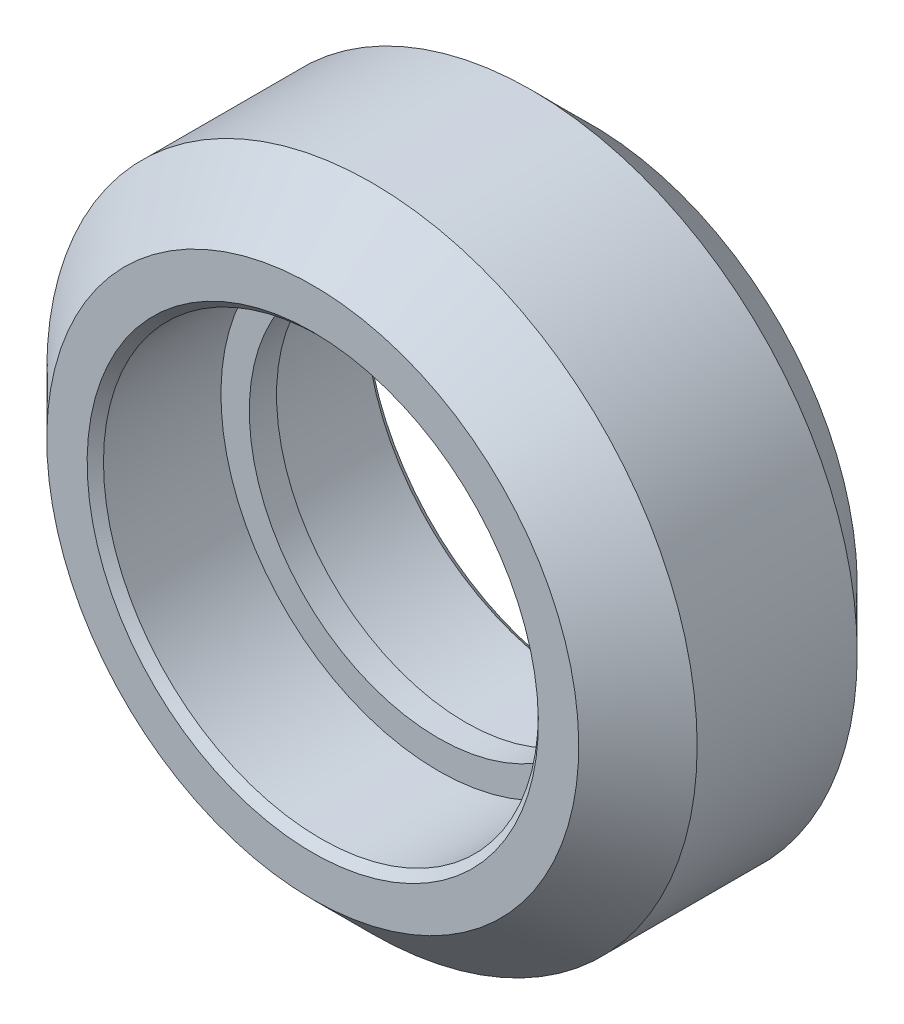
ISO-10303-21;
HEADER;
FILE_DESCRIPTION(('STEP AP214'),'2;1');
FILE_NAME('part.step','',(''),(''),'','','');
FILE_SCHEMA(('AUTOMOTIVE_DESIGN { 1 0 10303 214 1 1 1 1 }'));
ENDSEC;
DATA;
#1=APPLICATION_CONTEXT('core data for automotive mechanical design processes');
#2=APPLICATION_PROTOCOL_DEFINITION('international standard','automotive_design',2000,#1);
#3=PRODUCT_CONTEXT('',#1,'mechanical');
#4=PRODUCT('Part','Part','',(#3));
#5=PRODUCT_RELATED_PRODUCT_CATEGORY('part','',(#4));
#6=PRODUCT_DEFINITION_FORMATION('','',#4);
#7=PRODUCT_DEFINITION_CONTEXT('part definition',#1,'design');
#8=PRODUCT_DEFINITION('design','',#6,#7);
#9=PRODUCT_DEFINITION_SHAPE('','',#8);
#10=(LENGTH_UNIT() NAMED_UNIT(*) SI_UNIT(.MILLI.,.METRE.));
#11=(NAMED_UNIT(*) PLANE_ANGLE_UNIT() SI_UNIT($,.RADIAN.));
#12=(NAMED_UNIT(*) SI_UNIT($,.STERADIAN.) SOLID_ANGLE_UNIT());
#13=UNCERTAINTY_MEASURE_WITH_UNIT(LENGTH_MEASURE(1.E-05),#10,'distance_accuracy_value','');
#14=(GEOMETRIC_REPRESENTATION_CONTEXT(3) GLOBAL_UNCERTAINTY_ASSIGNED_CONTEXT((#13)) GLOBAL_UNIT_ASSIGNED_CONTEXT((#10,
#11,#12)) REPRESENTATION_CONTEXT('',''));
#15=CARTESIAN_POINT('',(0.,0.,0.));
#16=DIRECTION('',(0.,0.,1.));
#17=DIRECTION('',(1.,0.,0.));
#18=AXIS2_PLACEMENT_3D('',#15,#16,#17);
#19=CARTESIAN_POINT('',(0.,0.,5.115));
#20=DIRECTION('',(0.,0.,1.));
#21=DIRECTION('',(0.,-1.,0.));
#22=AXIS2_PLACEMENT_3D('',#19,#20,#21);
#23=CYLINDRICAL_SURFACE('',#22,7.987);
#24=CARTESIAN_POINT('',(0.,0.,4.815));
#25=DIRECTION('',(0.,0.,-1.));
#26=DIRECTION('',(0.,1.,0.));
#27=AXIS2_PLACEMENT_3D('',#24,#25,#26);
#28=CIRCLE('',#27,7.987);
#29=CARTESIAN_POINT('',(0.,7.987,4.815));
#30=VERTEX_POINT('',#29);
#31=EDGE_CURVE('E45',#30,#30,#28,.F.);
#32=ORIENTED_EDGE('',*,*,#31,.T.);
#33=EDGE_LOOP('',(#32));
#34=FACE_BOUND('',#33,.T.);
#35=CARTESIAN_POINT('',(0.,0.,0.499999999999998));
#36=DIRECTION('',(0.,0.,1.));
#37=DIRECTION('',(0.,-1.,0.));
#38=AXIS2_PLACEMENT_3D('',#35,#36,#37);
#39=CIRCLE('',#38,7.987);
#40=CARTESIAN_POINT('',(0.,-7.987,0.499999999999996));
#41=VERTEX_POINT('',#40);
#42=EDGE_CURVE('E71',#41,#41,#39,.T.);
#43=ORIENTED_EDGE('',*,*,#42,.F.);
#44=EDGE_LOOP('',(#43));
#45=FACE_BOUND('',#44,.T.);
#46=ADVANCED_FACE('F30',(#34,#45),#23,.F.);
#47=CARTESIAN_POINT('',(0.,9.77,5.115));
#48=DIRECTION('',(0.,0.,-1.));
#49=DIRECTION('',(0.,1.,0.));
#50=AXIS2_PLACEMENT_3D('',#47,#48,#49);
#51=PLANE('',#50);
#52=CARTESIAN_POINT('',(0.,0.,5.115));
#53=DIRECTION('',(0.,0.,-1.));
#54=DIRECTION('',(0.,1.,0.));
#55=AXIS2_PLACEMENT_3D('',#52,#53,#54);
#56=CIRCLE('',#55,8.28699999999999);
#57=CARTESIAN_POINT('',(0.,8.28699999999999,5.115));
#58=VERTEX_POINT('',#57);
#59=EDGE_CURVE('E41',#58,#58,#56,.T.);
#60=ORIENTED_EDGE('',*,*,#59,.T.);
#61=EDGE_LOOP('',(#60));
#62=FACE_BOUND('',#61,.T.);
#63=CARTESIAN_POINT('',(0.,0.,5.115));
#64=DIRECTION('',(0.,0.,1.));
#65=DIRECTION('',(0.,-1.,0.));
#66=AXIS2_PLACEMENT_3D('',#63,#64,#65);
#67=CIRCLE('',#66,9.77);
#68=CARTESIAN_POINT('',(0.,-9.77,5.115));
#69=VERTEX_POINT('',#68);
#70=EDGE_CURVE('E50',#69,#69,#67,.T.);
#71=ORIENTED_EDGE('',*,*,#70,.T.);
#72=EDGE_LOOP('',(#71));
#73=FACE_BOUND('',#72,.T.);
#74=ADVANCED_FACE('F78',(#62,#73),#51,.F.);
#75=CARTESIAN_POINT('',(0.,0.,2.94));
#76=DIRECTION('',(0.,0.,-1.));
#77=DIRECTION('',(0.,1.,0.));
#78=AXIS2_PLACEMENT_3D('',#75,#76,#77);
#79=CONICAL_SURFACE('',#78,11.945,0.78539816339745);
#80=ORIENTED_EDGE('',*,*,#70,.F.);
#81=EDGE_LOOP('',(#80));
#82=FACE_BOUND('',#81,.T.);
#83=CARTESIAN_POINT('',(0.,0.,2.94));
#84=DIRECTION('',(0.,0.,1.));
#85=DIRECTION('',(0.,-1.,0.));
#86=AXIS2_PLACEMENT_3D('',#83,#84,#85);
#87=CIRCLE('',#86,11.945);
#88=CARTESIAN_POINT('',(0.,-11.945,2.94));
#89=VERTEX_POINT('',#88);
#90=EDGE_CURVE('E53',#89,#89,#87,.T.);
#91=ORIENTED_EDGE('',*,*,#90,.T.);
#92=EDGE_LOOP('',(#91));
#93=FACE_BOUND('',#92,.T.);
#94=ADVANCED_FACE('F84',(#82,#93),#79,.T.);
#95=CARTESIAN_POINT('',(0.,0.,5.115));
#96=DIRECTION('',(0.,0.,1.));
#97=DIRECTION('',(0.,-1.,0.));
#98=AXIS2_PLACEMENT_3D('',#95,#96,#97);
#99=CYLINDRICAL_SURFACE('',#98,11.945);
#100=ORIENTED_EDGE('',*,*,#90,.F.);
#101=EDGE_LOOP('',(#100));
#102=FACE_BOUND('',#101,.T.);
#103=CARTESIAN_POINT('',(0.,0.,-2.94000000000001));
#104=DIRECTION('',(0.,0.,1.));
#105=DIRECTION('',(0.,-1.,0.));
#106=AXIS2_PLACEMENT_3D('',#103,#104,#105);
#107=CIRCLE('',#106,11.945);
#108=CARTESIAN_POINT('',(0.,-11.945,-2.94000000000001));
#109=VERTEX_POINT('',#108);
#110=EDGE_CURVE('E56',#109,#109,#107,.T.);
#111=ORIENTED_EDGE('',*,*,#110,.T.);
#112=EDGE_LOOP('',(#111));
#113=FACE_BOUND('',#112,.T.);
#114=ADVANCED_FACE('F107',(#102,#113),#99,.T.);
#115=CARTESIAN_POINT('',(0.,0.,-5.115));
#116=DIRECTION('',(0.,0.,1.));
#117=DIRECTION('',(0.,-1.,0.));
#118=AXIS2_PLACEMENT_3D('',#115,#116,#117);
#119=CONICAL_SURFACE('',#118,9.77,0.78539816339745);
#120=ORIENTED_EDGE('',*,*,#110,.F.);
#121=EDGE_LOOP('',(#120));
#122=FACE_BOUND('',#121,.T.);
#123=CARTESIAN_POINT('',(0.,0.,-5.115));
#124=DIRECTION('',(0.,0.,1.));
#125=DIRECTION('',(0.,-1.,0.));
#126=AXIS2_PLACEMENT_3D('',#123,#124,#125);
#127=CIRCLE('',#126,9.77);
#128=CARTESIAN_POINT('',(0.,-9.77,-5.115));
#129=VERTEX_POINT('',#128);
#130=EDGE_CURVE('E59',#129,#129,#127,.T.);
#131=ORIENTED_EDGE('',*,*,#130,.T.);
#132=EDGE_LOOP('',(#131));
#133=FACE_BOUND('',#132,.T.);
#134=ADVANCED_FACE('F112',(#122,#133),#119,.T.);
#135=CARTESIAN_POINT('',(0.,9.77,-5.115));
#136=DIRECTION('',(0.,0.,1.));
#137=DIRECTION('',(0.,-1.,0.));
#138=AXIS2_PLACEMENT_3D('',#135,#136,#137);
#139=PLANE('',#138);
#140=CARTESIAN_POINT('',(0.,0.,-5.115));
#141=DIRECTION('',(0.,0.,1.));
#142=DIRECTION('',(0.,-1.,0.));
#143=AXIS2_PLACEMENT_3D('',#140,#141,#142);
#144=CIRCLE('',#143,8.287);
#145=CARTESIAN_POINT('',(0.,-8.287,-5.115));
#146=VERTEX_POINT('',#145);
#147=EDGE_CURVE('E37',#146,#146,#144,.T.);
#148=ORIENTED_EDGE('',*,*,#147,.T.);
#149=EDGE_LOOP('',(#148));
#150=FACE_BOUND('',#149,.T.);
#151=ORIENTED_EDGE('',*,*,#130,.F.);
#152=EDGE_LOOP('',(#151));
#153=FACE_BOUND('',#152,.T.);
#154=ADVANCED_FACE('F118',(#150,#153),#139,.F.);
#155=CARTESIAN_POINT('',(0.,0.,5.115));
#156=DIRECTION('',(0.,0.,1.));
#157=DIRECTION('',(0.,-1.,0.));
#158=AXIS2_PLACEMENT_3D('',#155,#156,#157);
#159=CYLINDRICAL_SURFACE('',#158,7.987);
#160=CARTESIAN_POINT('',(0.,0.,-4.815));
#161=DIRECTION('',(0.,0.,1.));
#162=DIRECTION('',(0.,-1.,0.));
#163=AXIS2_PLACEMENT_3D('',#160,#161,#162);
#164=CIRCLE('',#163,7.987);
#165=CARTESIAN_POINT('',(0.,-7.987,-4.815));
#166=VERTEX_POINT('',#165);
#167=EDGE_CURVE('E10',#166,#166,#164,.F.);
#168=ORIENTED_EDGE('',*,*,#167,.T.);
#169=EDGE_LOOP('',(#168));
#170=FACE_BOUND('',#169,.T.);
#171=CARTESIAN_POINT('',(0.,0.,-0.500000000000001));
#172=DIRECTION('',(0.,0.,1.));
#173=DIRECTION('',(0.,-1.,0.));
#174=AXIS2_PLACEMENT_3D('',#171,#172,#173);
#175=CIRCLE('',#174,7.987);
#176=CARTESIAN_POINT('',(0.,-7.987,-0.500000000000003));
#177=VERTEX_POINT('',#176);
#178=EDGE_CURVE('E62',#177,#177,#175,.T.);
#179=ORIENTED_EDGE('',*,*,#178,.T.);
#180=EDGE_LOOP('',(#179));
#181=FACE_BOUND('',#180,.T.);
#182=ADVANCED_FACE('F123',(#170,#181),#159,.F.);
#183=CARTESIAN_POINT('',(0.,7.987,-0.5));
#184=DIRECTION('',(0.,0.,1.));
#185=DIRECTION('',(0.,-1.,0.));
#186=AXIS2_PLACEMENT_3D('',#183,#184,#185);
#187=PLANE('',#186);
#188=ORIENTED_EDGE('',*,*,#178,.F.);
#189=EDGE_LOOP('',(#188));
#190=FACE_BOUND('',#189,.T.);
#191=CARTESIAN_POINT('',(0.,0.,-0.500000000000002));
#192=DIRECTION('',(0.,0.,1.));
#193=DIRECTION('',(0.,-1.,0.));
#194=AXIS2_PLACEMENT_3D('',#191,#192,#193);
#195=CIRCLE('',#194,6.945);
#196=CARTESIAN_POINT('',(0.,-6.945,-0.500000000000003));
#197=VERTEX_POINT('',#196);
#198=EDGE_CURVE('E65',#197,#197,#195,.T.);
#199=ORIENTED_EDGE('',*,*,#198,.T.);
#200=EDGE_LOOP('',(#199));
#201=FACE_BOUND('',#200,.T.);
#202=ADVANCED_FACE('F128',(#190,#201),#187,.F.);
#203=CARTESIAN_POINT('',(0.,0.,5.115));
#204=DIRECTION('',(0.,0.,1.));
#205=DIRECTION('',(0.,-1.,0.));
#206=AXIS2_PLACEMENT_3D('',#203,#204,#205);
#207=CYLINDRICAL_SURFACE('',#206,6.945);
#208=ORIENTED_EDGE('',*,*,#198,.F.);
#209=EDGE_LOOP('',(#208));
#210=FACE_BOUND('',#209,.T.);
#211=CARTESIAN_POINT('',(0.,0.,0.499999999999999));
#212=DIRECTION('',(0.,0.,1.));
#213=DIRECTION('',(0.,-1.,0.));
#214=AXIS2_PLACEMENT_3D('',#211,#212,#213);
#215=CIRCLE('',#214,6.945);
#216=CARTESIAN_POINT('',(0.,-6.945,0.499999999999997));
#217=VERTEX_POINT('',#216);
#218=EDGE_CURVE('E68',#217,#217,#215,.T.);
#219=ORIENTED_EDGE('',*,*,#218,.T.);
#220=EDGE_LOOP('',(#219));
#221=FACE_BOUND('',#220,.T.);
#222=ADVANCED_FACE('F96',(#210,#221),#207,.F.);
#223=CARTESIAN_POINT('',(0.,7.987,0.5));
#224=DIRECTION('',(0.,0.,-1.));
#225=DIRECTION('',(0.,1.,0.));
#226=AXIS2_PLACEMENT_3D('',#223,#224,#225);
#227=PLANE('',#226);
#228=ORIENTED_EDGE('',*,*,#218,.F.);
#229=EDGE_LOOP('',(#228));
#230=FACE_BOUND('',#229,.T.);
#231=ORIENTED_EDGE('',*,*,#42,.T.);
#232=EDGE_LOOP('',(#231));
#233=FACE_BOUND('',#232,.T.);
#234=ADVANCED_FACE('F75',(#230,#233),#227,.F.);
#235=CARTESIAN_POINT('',(0.,0.,4.815));
#236=DIRECTION('',(0.,0.,1.));
#237=DIRECTION('',(0.,-1.,0.));
#238=AXIS2_PLACEMENT_3D('',#235,#236,#237);
#239=CONICAL_SURFACE('',#238,7.987,0.785398163397443);
#240=ORIENTED_EDGE('',*,*,#59,.F.);
#241=EDGE_LOOP('',(#240));
#242=FACE_BOUND('',#241,.T.);
#243=ORIENTED_EDGE('',*,*,#31,.F.);
#244=EDGE_LOOP('',(#243));
#245=FACE_BOUND('',#244,.T.);
#246=ADVANCED_FACE('F88',(#242,#245),#239,.F.);
#247=CARTESIAN_POINT('',(0.,0.,-5.115));
#248=DIRECTION('',(0.,0.,-1.));
#249=DIRECTION('',(0.,1.,0.));
#250=AXIS2_PLACEMENT_3D('',#247,#248,#249);
#251=CONICAL_SURFACE('',#250,8.287,0.785398163397443);
#252=ORIENTED_EDGE('',*,*,#167,.F.);
#253=EDGE_LOOP('',(#252));
#254=FACE_BOUND('',#253,.T.);
#255=ORIENTED_EDGE('',*,*,#147,.F.);
#256=EDGE_LOOP('',(#255));
#257=FACE_BOUND('',#256,.T.);
#258=ADVANCED_FACE('F32',(#254,#257),#251,.F.);
#259=CLOSED_SHELL('',(#46,#74,#94,#114,#134,#154,#182,#202,#222,#234,#246,#258));
#260=MANIFOLD_SOLID_BREP('B2',#259);
#261=ADVANCED_BREP_SHAPE_REPRESENTATION('',(#18,#260),#14);
#262=SHAPE_DEFINITION_REPRESENTATION(#9,#261);
ENDSEC;
END-ISO-10303-21;
